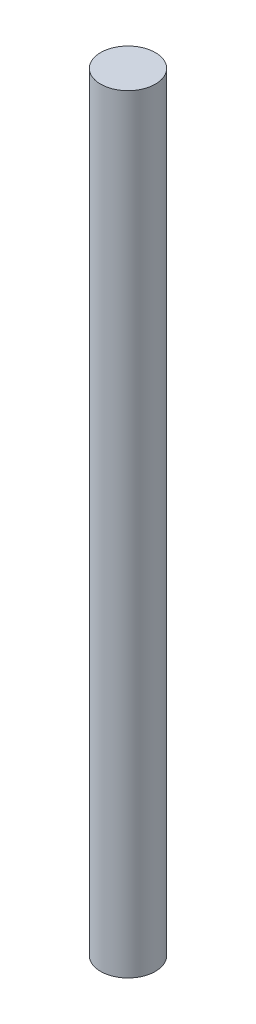
ISO-10303-21;
HEADER;
FILE_DESCRIPTION(('STEP AP214'),'2;1');
FILE_NAME('part.step','',(''),(''),'','','');
FILE_SCHEMA(('AUTOMOTIVE_DESIGN { 1 0 10303 214 1 1 1 1 }'));
ENDSEC;
DATA;
#1=APPLICATION_CONTEXT('core data for automotive mechanical design processes');
#2=APPLICATION_PROTOCOL_DEFINITION('international standard','automotive_design',2000,#1);
#3=PRODUCT_CONTEXT('',#1,'mechanical');
#4=PRODUCT('Part','Part','',(#3));
#5=PRODUCT_RELATED_PRODUCT_CATEGORY('part','',(#4));
#6=PRODUCT_DEFINITION_FORMATION('','',#4);
#7=PRODUCT_DEFINITION_CONTEXT('part definition',#1,'design');
#8=PRODUCT_DEFINITION('design','',#6,#7);
#9=PRODUCT_DEFINITION_SHAPE('','',#8);
#10=(LENGTH_UNIT() NAMED_UNIT(*) SI_UNIT(.MILLI.,.METRE.));
#11=(NAMED_UNIT(*) PLANE_ANGLE_UNIT() SI_UNIT($,.RADIAN.));
#12=(NAMED_UNIT(*) SI_UNIT($,.STERADIAN.) SOLID_ANGLE_UNIT());
#13=UNCERTAINTY_MEASURE_WITH_UNIT(LENGTH_MEASURE(1.E-05),#10,'distance_accuracy_value','');
#14=(GEOMETRIC_REPRESENTATION_CONTEXT(3) GLOBAL_UNCERTAINTY_ASSIGNED_CONTEXT((#13)) GLOBAL_UNIT_ASSIGNED_CONTEXT((#10,
#11,#12)) REPRESENTATION_CONTEXT('',''));
#15=CARTESIAN_POINT('',(0.,0.,0.));
#16=DIRECTION('',(0.,0.,1.));
#17=DIRECTION('',(1.,0.,0.));
#18=AXIS2_PLACEMENT_3D('',#15,#16,#17);
#19=CARTESIAN_POINT('',(0.,-50.,0.));
#20=DIRECTION('',(0.,1.,0.));
#21=DIRECTION('',(0.,0.,1.));
#22=AXIS2_PLACEMENT_3D('',#19,#20,#21);
#23=CYLINDRICAL_SURFACE('',#22,2.5);
#24=CARTESIAN_POINT('',(0.,-50.,0.));
#25=DIRECTION('',(0.,1.,0.));
#26=DIRECTION('',(0.,0.,1.));
#27=AXIS2_PLACEMENT_3D('',#24,#25,#26);
#28=CIRCLE('',#27,2.5);
#29=CARTESIAN_POINT('',(0.,-50.,2.5));
#30=VERTEX_POINT('',#29);
#31=EDGE_CURVE('E10',#30,#30,#28,.T.);
#32=ORIENTED_EDGE('',*,*,#31,.T.);
#33=EDGE_LOOP('',(#32));
#34=FACE_BOUND('',#33,.T.);
#35=CARTESIAN_POINT('',(0.,20.2,0.));
#36=DIRECTION('',(0.,1.,0.));
#37=DIRECTION('',(0.,0.,1.));
#38=AXIS2_PLACEMENT_3D('',#35,#36,#37);
#39=CIRCLE('',#38,2.5);
#40=CARTESIAN_POINT('',(0.,20.2,2.5));
#41=VERTEX_POINT('',#40);
#42=EDGE_CURVE('E36',#41,#41,#39,.T.);
#43=ORIENTED_EDGE('',*,*,#42,.F.);
#44=EDGE_LOOP('',(#43));
#45=FACE_BOUND('',#44,.T.);
#46=ADVANCED_FACE('F30',(#34,#45),#23,.T.);
#47=CARTESIAN_POINT('',(0.,-50.,0.));
#48=DIRECTION('',(0.,1.,0.));
#49=DIRECTION('',(0.,0.,1.));
#50=AXIS2_PLACEMENT_3D('',#47,#48,#49);
#51=PLANE('',#50);
#52=ORIENTED_EDGE('',*,*,#31,.F.);
#53=EDGE_LOOP('',(#52));
#54=FACE_BOUND('',#53,.T.);
#55=ADVANCED_FACE('F45',(#54),#51,.F.);
#56=CARTESIAN_POINT('',(0.,20.2,0.));
#57=DIRECTION('',(0.,1.,0.));
#58=DIRECTION('',(0.,0.,1.));
#59=AXIS2_PLACEMENT_3D('',#56,#57,#58);
#60=PLANE('',#59);
#61=ORIENTED_EDGE('',*,*,#42,.T.);
#62=EDGE_LOOP('',(#61));
#63=FACE_BOUND('',#62,.T.);
#64=ADVANCED_FACE('F42',(#63),#60,.T.);
#65=CLOSED_SHELL('',(#46,#55,#64));
#66=MANIFOLD_SOLID_BREP('B2',#65);
#67=ADVANCED_BREP_SHAPE_REPRESENTATION('',(#18,#66),#14);
#68=SHAPE_DEFINITION_REPRESENTATION(#9,#67);
ENDSEC;
END-ISO-10303-21;
